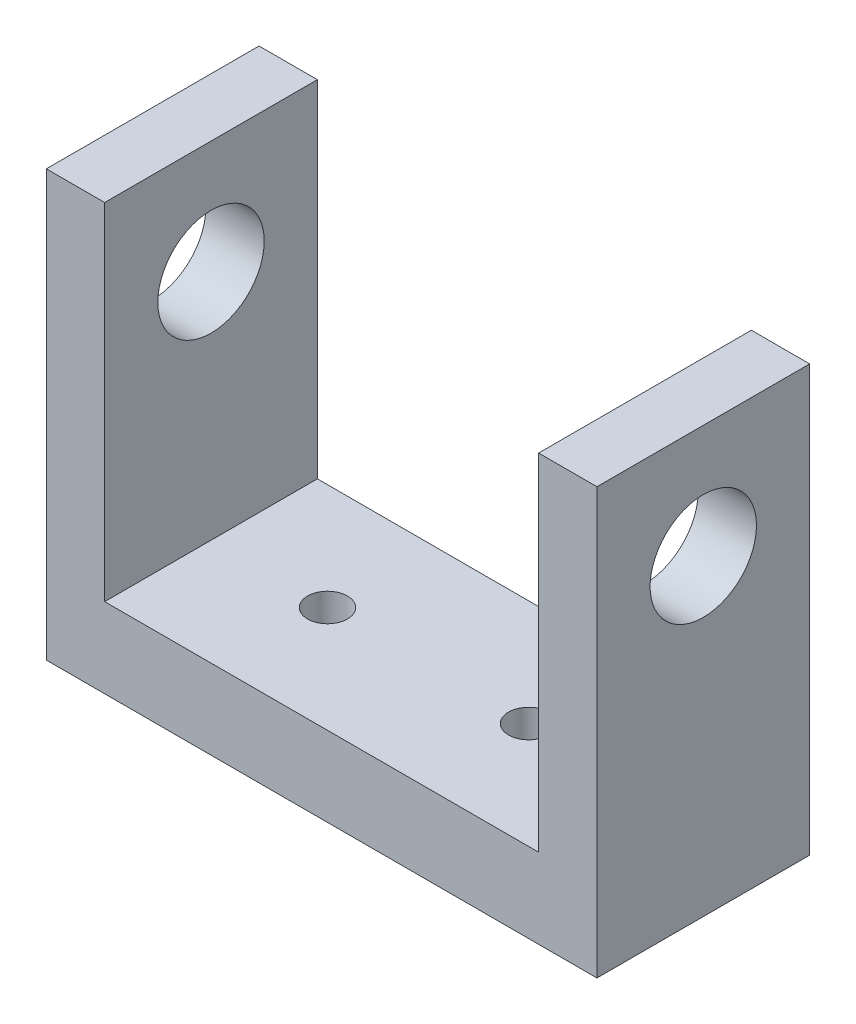
ISO-10303-21;
HEADER;
FILE_DESCRIPTION(('STEP AP214'),'2;1');
FILE_NAME('part.step','',(''),(''),'','','');
FILE_SCHEMA(('AUTOMOTIVE_DESIGN { 1 0 10303 214 1 1 1 1 }'));
ENDSEC;
DATA;
#1=APPLICATION_CONTEXT('core data for automotive mechanical design processes');
#2=APPLICATION_PROTOCOL_DEFINITION('international standard','automotive_design',2000,#1);
#3=PRODUCT_CONTEXT('',#1,'mechanical');
#4=PRODUCT('Part','Part','',(#3));
#5=PRODUCT_RELATED_PRODUCT_CATEGORY('part','',(#4));
#6=PRODUCT_DEFINITION_FORMATION('','',#4);
#7=PRODUCT_DEFINITION_CONTEXT('part definition',#1,'design');
#8=PRODUCT_DEFINITION('design','',#6,#7);
#9=PRODUCT_DEFINITION_SHAPE('','',#8);
#10=(LENGTH_UNIT() NAMED_UNIT(*) SI_UNIT(.MILLI.,.METRE.));
#11=(NAMED_UNIT(*) PLANE_ANGLE_UNIT() SI_UNIT($,.RADIAN.));
#12=(NAMED_UNIT(*) SI_UNIT($,.STERADIAN.) SOLID_ANGLE_UNIT());
#13=UNCERTAINTY_MEASURE_WITH_UNIT(LENGTH_MEASURE(1.E-05),#10,'distance_accuracy_value','');
#14=(GEOMETRIC_REPRESENTATION_CONTEXT(3) GLOBAL_UNCERTAINTY_ASSIGNED_CONTEXT((#13)) GLOBAL_UNIT_ASSIGNED_CONTEXT((#10,
#11,#12)) REPRESENTATION_CONTEXT('',''));
#15=CARTESIAN_POINT('',(0.,0.,0.));
#16=DIRECTION('',(0.,0.,1.));
#17=DIRECTION('',(1.,0.,0.));
#18=AXIS2_PLACEMENT_3D('',#15,#16,#17);
#19=CARTESIAN_POINT('',(8.21764705882353,12.7,-3.175));
#20=DIRECTION('',(0.,-1.,0.));
#21=DIRECTION('',(0.,0.,-1.));
#22=AXIS2_PLACEMENT_3D('',#19,#20,#21);
#23=PLANE('',#22);
#24=DIRECTION('',(1.,0.,0.));
#25=VECTOR('',#24,1.);
#26=CARTESIAN_POINT('',(-8.21764705882353,12.7,3.175));
#27=LINE('',#26,#25);
#28=CARTESIAN_POINT('',(-8.21764705882353,12.7,3.175));
#29=VERTEX_POINT('',#28);
#30=CARTESIAN_POINT('',(-6.477,12.7,3.175));
#31=VERTEX_POINT('',#30);
#32=EDGE_CURVE('E144',#29,#31,#27,.T.);
#33=ORIENTED_EDGE('',*,*,#32,.T.);
#34=DIRECTION('',(0.,0.,1.));
#35=VECTOR('',#34,1.);
#36=CARTESIAN_POINT('',(-6.477,12.7,3.175));
#37=LINE('',#36,#35);
#38=CARTESIAN_POINT('',(-6.477,12.7,-3.175));
#39=VERTEX_POINT('',#38);
#40=EDGE_CURVE('E126',#39,#31,#37,.T.);
#41=ORIENTED_EDGE('',*,*,#40,.F.);
#42=DIRECTION('',(-1.,0.,0.));
#43=VECTOR('',#42,1.);
#44=CARTESIAN_POINT('',(-8.21764705882353,12.7,-3.175));
#45=LINE('',#44,#43);
#46=CARTESIAN_POINT('',(-8.21764705882353,12.7,-3.175));
#47=VERTEX_POINT('',#46);
#48=EDGE_CURVE('E131',#39,#47,#45,.T.);
#49=ORIENTED_EDGE('',*,*,#48,.T.);
#50=DIRECTION('',(0.,0.,1.));
#51=VECTOR('',#50,1.);
#52=CARTESIAN_POINT('',(-8.21764705882353,12.7,3.175));
#53=LINE('',#52,#51);
#54=EDGE_CURVE('E142',#47,#29,#53,.T.);
#55=ORIENTED_EDGE('',*,*,#54,.T.);
#56=EDGE_LOOP('',(#33,#41,#49,#55));
#57=FACE_BOUND('',#56,.T.);
#58=ADVANCED_FACE('F34',(#57),#23,.F.);
#59=CARTESIAN_POINT('',(8.21764705882353,12.7,3.175));
#60=DIRECTION('',(-1.,0.,0.));
#61=DIRECTION('',(0.,0.,1.));
#62=AXIS2_PLACEMENT_3D('',#59,#60,#61);
#63=PLANE('',#62);
#64=CARTESIAN_POINT('',(8.21764705882353,9.3218,0.));
#65=DIRECTION('',(1.,0.,0.));
#66=DIRECTION('',(0.,0.,-1.));
#67=AXIS2_PLACEMENT_3D('',#64,#65,#66);
#68=CIRCLE('',#67,1.5875);
#69=CARTESIAN_POINT('',(8.21764705882353,9.3218,-1.5875));
#70=VERTEX_POINT('',#69);
#71=EDGE_CURVE('E181',#70,#70,#68,.T.);
#72=ORIENTED_EDGE('',*,*,#71,.F.);
#73=EDGE_LOOP('',(#72));
#74=FACE_BOUND('',#73,.T.);
#75=DIRECTION('',(0.,0.,-1.));
#76=VECTOR('',#75,1.);
#77=CARTESIAN_POINT('',(8.21764705882353,0.,3.175));
#78=LINE('',#77,#76);
#79=CARTESIAN_POINT('',(8.21764705882353,0.,3.175));
#80=VERTEX_POINT('',#79);
#81=CARTESIAN_POINT('',(8.21764705882353,0.,-3.175));
#82=VERTEX_POINT('',#81);
#83=EDGE_CURVE('E138',#80,#82,#78,.T.);
#84=ORIENTED_EDGE('',*,*,#83,.T.);
#85=DIRECTION('',(0.,-1.,0.));
#86=VECTOR('',#85,1.);
#87=CARTESIAN_POINT('',(8.21764705882353,12.7,-3.175));
#88=LINE('',#87,#86);
#89=CARTESIAN_POINT('',(8.21764705882353,12.7,-3.175));
#90=VERTEX_POINT('',#89);
#91=EDGE_CURVE('E12',#90,#82,#88,.T.);
#92=ORIENTED_EDGE('',*,*,#91,.F.);
#93=DIRECTION('',(0.,0.,-1.));
#94=VECTOR('',#93,1.);
#95=CARTESIAN_POINT('',(8.21764705882353,12.7,3.175));
#96=LINE('',#95,#94);
#97=CARTESIAN_POINT('',(8.21764705882353,12.7,3.175));
#98=VERTEX_POINT('',#97);
#99=EDGE_CURVE('E139',#98,#90,#96,.T.);
#100=ORIENTED_EDGE('',*,*,#99,.F.);
#101=DIRECTION('',(0.,-1.,0.));
#102=VECTOR('',#101,1.);
#103=CARTESIAN_POINT('',(8.21764705882353,12.7,3.175));
#104=LINE('',#103,#102);
#105=EDGE_CURVE('E147',#98,#80,#104,.T.);
#106=ORIENTED_EDGE('',*,*,#105,.T.);
#107=EDGE_LOOP('',(#84,#92,#100,#106));
#108=FACE_BOUND('',#107,.T.);
#109=ADVANCED_FACE('F36',(#74,#108),#63,.F.);
#110=CARTESIAN_POINT('',(-8.21764705882353,12.7,-3.175));
#111=DIRECTION('',(0.,0.,1.));
#112=DIRECTION('',(1.,0.,0.));
#113=AXIS2_PLACEMENT_3D('',#110,#111,#112);
#114=PLANE('',#113);
#115=ORIENTED_EDGE('',*,*,#48,.F.);
#116=DIRECTION('',(0.,1.,0.));
#117=VECTOR('',#116,1.);
#118=CARTESIAN_POINT('',(-6.477,-14.4266633703015,-3.175));
#119=LINE('',#118,#117);
#120=CARTESIAN_POINT('',(-6.477,2.38125,-3.175));
#121=VERTEX_POINT('',#120);
#122=EDGE_CURVE('E113',#121,#39,#119,.T.);
#123=ORIENTED_EDGE('',*,*,#122,.F.);
#124=DIRECTION('',(-1.,0.,0.));
#125=VECTOR('',#124,1.);
#126=CARTESIAN_POINT('',(-6.477,2.38125,-3.175));
#127=LINE('',#126,#125);
#128=CARTESIAN_POINT('',(6.477,2.38125,-3.175));
#129=VERTEX_POINT('',#128);
#130=EDGE_CURVE('E122',#129,#121,#127,.T.);
#131=ORIENTED_EDGE('',*,*,#130,.F.);
#132=DIRECTION('',(0.,1.,0.));
#133=VECTOR('',#132,1.);
#134=CARTESIAN_POINT('',(6.477,-14.4266633703015,-3.175));
#135=LINE('',#134,#133);
#136=CARTESIAN_POINT('',(6.477,12.7,-3.175));
#137=VERTEX_POINT('',#136);
#138=EDGE_CURVE('E136',#129,#137,#135,.T.);
#139=ORIENTED_EDGE('',*,*,#138,.T.);
#140=EDGE_CURVE('E87',#90,#137,#45,.T.);
#141=ORIENTED_EDGE('',*,*,#140,.F.);
#142=ORIENTED_EDGE('',*,*,#91,.T.);
#143=DIRECTION('',(-1.,0.,0.));
#144=VECTOR('',#143,1.);
#145=CARTESIAN_POINT('',(-8.21764705882353,0.,-3.175));
#146=LINE('',#145,#144);
#147=CARTESIAN_POINT('',(-8.21764705882353,0.,-3.175));
#148=VERTEX_POINT('',#147);
#149=EDGE_CURVE('E150',#82,#148,#146,.T.);
#150=ORIENTED_EDGE('',*,*,#149,.T.);
#151=DIRECTION('',(0.,-1.,0.));
#152=VECTOR('',#151,1.);
#153=CARTESIAN_POINT('',(-8.21764705882353,12.7,-3.175));
#154=LINE('',#153,#152);
#155=EDGE_CURVE('E43',#47,#148,#154,.T.);
#156=ORIENTED_EDGE('',*,*,#155,.F.);
#157=EDGE_LOOP('',(#115,#123,#131,#139,#141,#142,#150,#156));
#158=FACE_BOUND('',#157,.T.);
#159=ADVANCED_FACE('F129',(#158),#114,.F.);
#160=CARTESIAN_POINT('',(-8.21764705882353,12.7,3.175));
#161=DIRECTION('',(1.,0.,0.));
#162=DIRECTION('',(0.,0.,-1.));
#163=AXIS2_PLACEMENT_3D('',#160,#161,#162);
#164=PLANE('',#163);
#165=CARTESIAN_POINT('',(-8.21764705882353,9.3218,0.));
#166=DIRECTION('',(1.,0.,0.));
#167=DIRECTION('',(0.,0.,-1.));
#168=AXIS2_PLACEMENT_3D('',#165,#166,#167);
#169=CIRCLE('',#168,1.5875);
#170=CARTESIAN_POINT('',(-8.21764705882353,9.3218,-1.5875));
#171=VERTEX_POINT('',#170);
#172=EDGE_CURVE('E184',#171,#171,#169,.T.);
#173=ORIENTED_EDGE('',*,*,#172,.T.);
#174=EDGE_LOOP('',(#173));
#175=FACE_BOUND('',#174,.T.);
#176=DIRECTION('',(0.,0.,1.));
#177=VECTOR('',#176,1.);
#178=CARTESIAN_POINT('',(-8.21764705882353,0.,3.175));
#179=LINE('',#178,#177);
#180=CARTESIAN_POINT('',(-8.21764705882353,0.,3.175));
#181=VERTEX_POINT('',#180);
#182=EDGE_CURVE('E152',#148,#181,#179,.T.);
#183=ORIENTED_EDGE('',*,*,#182,.T.);
#184=DIRECTION('',(0.,-1.,0.));
#185=VECTOR('',#184,1.);
#186=CARTESIAN_POINT('',(-8.21764705882353,12.7,3.175));
#187=LINE('',#186,#185);
#188=EDGE_CURVE('E156',#29,#181,#187,.T.);
#189=ORIENTED_EDGE('',*,*,#188,.F.);
#190=ORIENTED_EDGE('',*,*,#54,.F.);
#191=ORIENTED_EDGE('',*,*,#155,.T.);
#192=EDGE_LOOP('',(#183,#189,#190,#191));
#193=FACE_BOUND('',#192,.T.);
#194=ADVANCED_FACE('F162',(#175,#193),#164,.F.);
#195=CARTESIAN_POINT('',(-8.21764705882353,12.7,3.175));
#196=DIRECTION('',(0.,0.,-1.));
#197=DIRECTION('',(-1.,0.,0.));
#198=AXIS2_PLACEMENT_3D('',#195,#196,#197);
#199=PLANE('',#198);
#200=DIRECTION('',(1.,0.,0.));
#201=VECTOR('',#200,1.);
#202=CARTESIAN_POINT('',(-6.477,2.38125,3.175));
#203=LINE('',#202,#201);
#204=CARTESIAN_POINT('',(-6.477,2.38125,3.175));
#205=VERTEX_POINT('',#204);
#206=CARTESIAN_POINT('',(6.477,2.38125,3.175));
#207=VERTEX_POINT('',#206);
#208=EDGE_CURVE('E171',#205,#207,#203,.T.);
#209=ORIENTED_EDGE('',*,*,#208,.F.);
#210=DIRECTION('',(0.,1.,0.));
#211=VECTOR('',#210,1.);
#212=CARTESIAN_POINT('',(-6.477,-14.4266633703015,3.175));
#213=LINE('',#212,#211);
#214=EDGE_CURVE('E116',#205,#31,#213,.T.);
#215=ORIENTED_EDGE('',*,*,#214,.T.);
#216=ORIENTED_EDGE('',*,*,#32,.F.);
#217=ORIENTED_EDGE('',*,*,#188,.T.);
#218=DIRECTION('',(1.,0.,0.));
#219=VECTOR('',#218,1.);
#220=CARTESIAN_POINT('',(-8.21764705882353,0.,3.175));
#221=LINE('',#220,#219);
#222=EDGE_CURVE('E80',#181,#80,#221,.T.);
#223=ORIENTED_EDGE('',*,*,#222,.T.);
#224=ORIENTED_EDGE('',*,*,#105,.F.);
#225=CARTESIAN_POINT('',(6.477,12.7,3.175));
#226=VERTEX_POINT('',#225);
#227=EDGE_CURVE('E58',#226,#98,#27,.T.);
#228=ORIENTED_EDGE('',*,*,#227,.F.);
#229=DIRECTION('',(0.,1.,0.));
#230=VECTOR('',#229,1.);
#231=CARTESIAN_POINT('',(6.477,-14.4266633703015,3.175));
#232=LINE('',#231,#230);
#233=EDGE_CURVE('E50',#207,#226,#232,.T.);
#234=ORIENTED_EDGE('',*,*,#233,.F.);
#235=EDGE_LOOP('',(#209,#215,#216,#217,#223,#224,#228,#234));
#236=FACE_BOUND('',#235,.T.);
#237=ADVANCED_FACE('F170',(#236),#199,.F.);
#238=ORIENTED_EDGE('',*,*,#140,.T.);
#239=DIRECTION('',(0.,0.,-1.));
#240=VECTOR('',#239,1.);
#241=CARTESIAN_POINT('',(6.477,12.7,3.175));
#242=LINE('',#241,#240);
#243=EDGE_CURVE('E175',#226,#137,#242,.T.);
#244=ORIENTED_EDGE('',*,*,#243,.F.);
#245=ORIENTED_EDGE('',*,*,#227,.T.);
#246=ORIENTED_EDGE('',*,*,#99,.T.);
#247=EDGE_LOOP('',(#238,#244,#245,#246));
#248=FACE_BOUND('',#247,.T.);
#249=ADVANCED_FACE('F225',(#248),#23,.F.);
#250=CARTESIAN_POINT('',(8.21764705882353,0.,-3.175));
#251=DIRECTION('',(0.,-1.,0.));
#252=DIRECTION('',(0.,0.,-1.));
#253=AXIS2_PLACEMENT_3D('',#250,#251,#252);
#254=PLANE('',#253);
#255=CARTESIAN_POINT('',(-3.,0.,0.));
#256=DIRECTION('',(0.,1.,0.));
#257=DIRECTION('',(0.,0.,1.));
#258=AXIS2_PLACEMENT_3D('',#255,#256,#257);
#259=CIRCLE('',#258,0.595629999999999);
#260=CARTESIAN_POINT('',(-3.,0.,0.595629999999999));
#261=VERTEX_POINT('',#260);
#262=EDGE_CURVE('E193',#261,#261,#259,.T.);
#263=ORIENTED_EDGE('',*,*,#262,.T.);
#264=EDGE_LOOP('',(#263));
#265=FACE_BOUND('',#264,.T.);
#266=CARTESIAN_POINT('',(3.,0.,0.));
#267=DIRECTION('',(0.,1.,0.));
#268=DIRECTION('',(0.,0.,1.));
#269=AXIS2_PLACEMENT_3D('',#266,#267,#268);
#270=CIRCLE('',#269,0.595629999999999);
#271=CARTESIAN_POINT('',(3.,0.,0.595629999999999));
#272=VERTEX_POINT('',#271);
#273=EDGE_CURVE('E185',#272,#272,#270,.T.);
#274=ORIENTED_EDGE('',*,*,#273,.T.);
#275=EDGE_LOOP('',(#274));
#276=FACE_BOUND('',#275,.T.);
#277=ORIENTED_EDGE('',*,*,#83,.F.);
#278=ORIENTED_EDGE('',*,*,#222,.F.);
#279=ORIENTED_EDGE('',*,*,#182,.F.);
#280=ORIENTED_EDGE('',*,*,#149,.F.);
#281=EDGE_LOOP('',(#277,#278,#279,#280));
#282=FACE_BOUND('',#281,.T.);
#283=ADVANCED_FACE('F166',(#265,#276,#282),#254,.T.);
#284=CARTESIAN_POINT('',(8.21764705882353,2.38125,-3.175));
#285=DIRECTION('',(0.,-1.,0.));
#286=DIRECTION('',(0.,0.,-1.));
#287=AXIS2_PLACEMENT_3D('',#284,#285,#286);
#288=PLANE('',#287);
#289=CARTESIAN_POINT('',(-3.,2.38125,0.));
#290=DIRECTION('',(0.,1.,0.));
#291=DIRECTION('',(0.,0.,1.));
#292=AXIS2_PLACEMENT_3D('',#289,#290,#291);
#293=CIRCLE('',#292,0.595629999999988);
#294=CARTESIAN_POINT('',(-3.,2.38125,0.595629999999988));
#295=VERTEX_POINT('',#294);
#296=EDGE_CURVE('E196',#295,#295,#293,.T.);
#297=ORIENTED_EDGE('',*,*,#296,.F.);
#298=EDGE_LOOP('',(#297));
#299=FACE_BOUND('',#298,.T.);
#300=CARTESIAN_POINT('',(3.,2.38125,0.));
#301=DIRECTION('',(0.,1.,0.));
#302=DIRECTION('',(0.,0.,1.));
#303=AXIS2_PLACEMENT_3D('',#300,#301,#302);
#304=CIRCLE('',#303,0.595629999999988);
#305=CARTESIAN_POINT('',(3.,2.38125,0.595629999999988));
#306=VERTEX_POINT('',#305);
#307=EDGE_CURVE('E190',#306,#306,#304,.T.);
#308=ORIENTED_EDGE('',*,*,#307,.F.);
#309=EDGE_LOOP('',(#308));
#310=FACE_BOUND('',#309,.T.);
#311=DIRECTION('',(0.,0.,-1.));
#312=VECTOR('',#311,1.);
#313=CARTESIAN_POINT('',(6.477,2.38125,3.175));
#314=LINE('',#313,#312);
#315=EDGE_CURVE('E124',#207,#129,#314,.T.);
#316=ORIENTED_EDGE('',*,*,#315,.T.);
#317=ORIENTED_EDGE('',*,*,#130,.T.);
#318=DIRECTION('',(0.,0.,1.));
#319=VECTOR('',#318,1.);
#320=CARTESIAN_POINT('',(-6.477,2.38125,3.175));
#321=LINE('',#320,#319);
#322=EDGE_CURVE('E109',#121,#205,#321,.T.);
#323=ORIENTED_EDGE('',*,*,#322,.T.);
#324=ORIENTED_EDGE('',*,*,#208,.T.);
#325=EDGE_LOOP('',(#316,#317,#323,#324));
#326=FACE_BOUND('',#325,.T.);
#327=ADVANCED_FACE('F123',(#299,#310,#326),#288,.F.);
#328=CARTESIAN_POINT('',(-6.477,-14.4266633703015,3.175));
#329=DIRECTION('',(-1.,0.,0.));
#330=DIRECTION('',(0.,0.,1.));
#331=AXIS2_PLACEMENT_3D('',#328,#329,#330);
#332=PLANE('',#331);
#333=CARTESIAN_POINT('',(-6.477,9.3218,0.));
#334=DIRECTION('',(-1.,0.,0.));
#335=DIRECTION('',(0.,0.,1.));
#336=AXIS2_PLACEMENT_3D('',#333,#334,#335);
#337=CIRCLE('',#336,1.5875);
#338=CARTESIAN_POINT('',(-6.477,9.3218,1.5875));
#339=VERTEX_POINT('',#338);
#340=EDGE_CURVE('E177',#339,#339,#337,.T.);
#341=ORIENTED_EDGE('',*,*,#340,.T.);
#342=EDGE_LOOP('',(#341));
#343=FACE_BOUND('',#342,.T.);
#344=ORIENTED_EDGE('',*,*,#122,.T.);
#345=ORIENTED_EDGE('',*,*,#40,.T.);
#346=ORIENTED_EDGE('',*,*,#214,.F.);
#347=ORIENTED_EDGE('',*,*,#322,.F.);
#348=EDGE_LOOP('',(#344,#345,#346,#347));
#349=FACE_BOUND('',#348,.T.);
#350=ADVANCED_FACE('F111',(#343,#349),#332,.F.);
#351=CARTESIAN_POINT('',(6.477,-14.4266633703015,3.175));
#352=DIRECTION('',(1.,0.,0.));
#353=DIRECTION('',(0.,0.,-1.));
#354=AXIS2_PLACEMENT_3D('',#351,#352,#353);
#355=PLANE('',#354);
#356=CARTESIAN_POINT('',(6.477,9.3218,0.));
#357=DIRECTION('',(1.,0.,0.));
#358=DIRECTION('',(0.,0.,-1.));
#359=AXIS2_PLACEMENT_3D('',#356,#357,#358);
#360=CIRCLE('',#359,1.5875);
#361=CARTESIAN_POINT('',(6.477,9.3218,-1.5875));
#362=VERTEX_POINT('',#361);
#363=EDGE_CURVE('E38',#362,#362,#360,.T.);
#364=ORIENTED_EDGE('',*,*,#363,.T.);
#365=EDGE_LOOP('',(#364));
#366=FACE_BOUND('',#365,.T.);
#367=ORIENTED_EDGE('',*,*,#233,.T.);
#368=ORIENTED_EDGE('',*,*,#243,.T.);
#369=ORIENTED_EDGE('',*,*,#138,.F.);
#370=ORIENTED_EDGE('',*,*,#315,.F.);
#371=EDGE_LOOP('',(#367,#368,#369,#370));
#372=FACE_BOUND('',#371,.T.);
#373=ADVANCED_FACE('F238',(#366,#372),#355,.F.);
#374=CARTESIAN_POINT('',(-8.21764705882353,9.3218,0.));
#375=DIRECTION('',(1.,0.,0.));
#376=DIRECTION('',(0.,0.,-1.));
#377=AXIS2_PLACEMENT_3D('',#374,#375,#376);
#378=CYLINDRICAL_SURFACE('',#377,1.5875);
#379=ORIENTED_EDGE('',*,*,#71,.T.);
#380=EDGE_LOOP('',(#379));
#381=FACE_BOUND('',#380,.T.);
#382=ORIENTED_EDGE('',*,*,#363,.F.);
#383=EDGE_LOOP('',(#382));
#384=FACE_BOUND('',#383,.T.);
#385=ADVANCED_FACE('F218',(#381,#384),#378,.F.);
#386=ORIENTED_EDGE('',*,*,#172,.F.);
#387=EDGE_LOOP('',(#386));
#388=FACE_BOUND('',#387,.T.);
#389=ORIENTED_EDGE('',*,*,#340,.F.);
#390=EDGE_LOOP('',(#389));
#391=FACE_BOUND('',#390,.T.);
#392=ADVANCED_FACE('F209',(#388,#391),#378,.F.);
#393=CARTESIAN_POINT('',(3.,2.38125,0.));
#394=DIRECTION('',(0.,1.,0.));
#395=DIRECTION('',(0.,0.,1.));
#396=AXIS2_PLACEMENT_3D('',#393,#394,#395);
#397=CYLINDRICAL_SURFACE('',#396,0.595629999999993);
#398=ORIENTED_EDGE('',*,*,#273,.F.);
#399=EDGE_LOOP('',(#398));
#400=FACE_BOUND('',#399,.T.);
#401=ORIENTED_EDGE('',*,*,#307,.T.);
#402=EDGE_LOOP('',(#401));
#403=FACE_BOUND('',#402,.T.);
#404=ADVANCED_FACE('F207',(#400,#403),#397,.F.);
#405=CARTESIAN_POINT('',(-3.,2.38125,0.));
#406=DIRECTION('',(0.,1.,0.));
#407=DIRECTION('',(0.,0.,1.));
#408=AXIS2_PLACEMENT_3D('',#405,#406,#407);
#409=CYLINDRICAL_SURFACE('',#408,0.595629999999993);
#410=ORIENTED_EDGE('',*,*,#262,.F.);
#411=EDGE_LOOP('',(#410));
#412=FACE_BOUND('',#411,.T.);
#413=ORIENTED_EDGE('',*,*,#296,.T.);
#414=EDGE_LOOP('',(#413));
#415=FACE_BOUND('',#414,.T.);
#416=ADVANCED_FACE('F200',(#412,#415),#409,.F.);
#417=CLOSED_SHELL('',(#58,#109,#159,#194,#237,#249,#283,#327,#350,#373,#385,#392,#404,#416));
#418=MANIFOLD_SOLID_BREP('B2',#417);
#419=ADVANCED_BREP_SHAPE_REPRESENTATION('',(#18,#418),#14);
#420=SHAPE_DEFINITION_REPRESENTATION(#9,#419);
ENDSEC;
END-ISO-10303-21;
